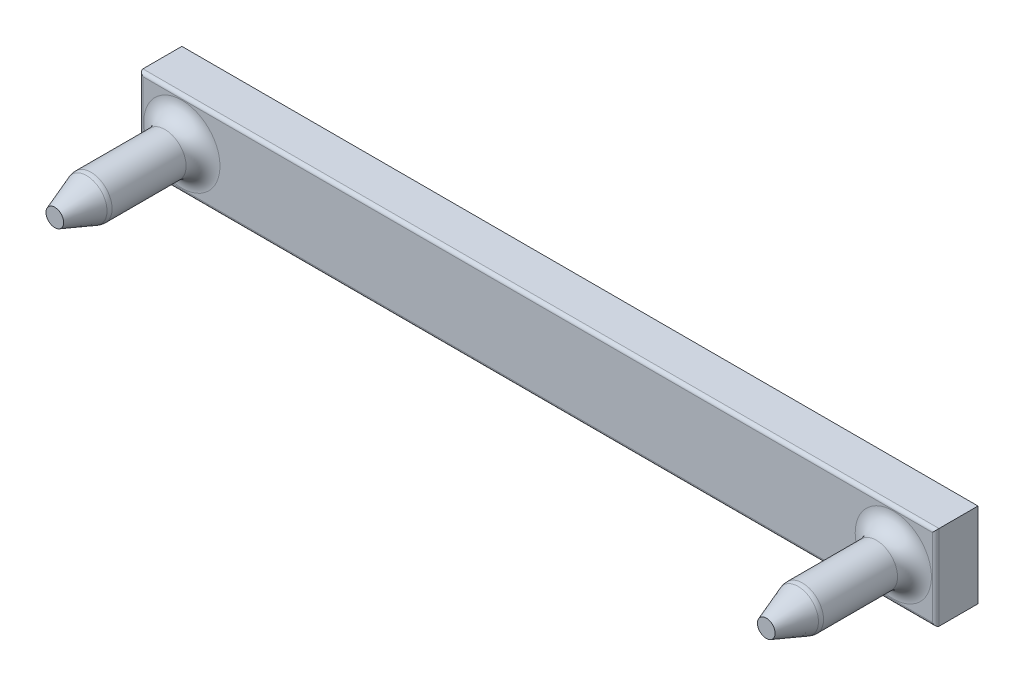
ISO-10303-21;
HEADER;
FILE_DESCRIPTION(('STEP AP214'),'2;1');
FILE_NAME('part.step','',(''),(''),'','','');
FILE_SCHEMA(('AUTOMOTIVE_DESIGN { 1 0 10303 214 1 1 1 1 }'));
ENDSEC;
DATA;
#1=APPLICATION_CONTEXT('core data for automotive mechanical design processes');
#2=APPLICATION_PROTOCOL_DEFINITION('international standard','automotive_design',2000,#1);
#3=PRODUCT_CONTEXT('',#1,'mechanical');
#4=PRODUCT('Part','Part','',(#3));
#5=PRODUCT_RELATED_PRODUCT_CATEGORY('part','',(#4));
#6=PRODUCT_DEFINITION_FORMATION('','',#4);
#7=PRODUCT_DEFINITION_CONTEXT('part definition',#1,'design');
#8=PRODUCT_DEFINITION('design','',#6,#7);
#9=PRODUCT_DEFINITION_SHAPE('','',#8);
#10=(LENGTH_UNIT() NAMED_UNIT(*) SI_UNIT(.MILLI.,.METRE.));
#11=(NAMED_UNIT(*) PLANE_ANGLE_UNIT() SI_UNIT($,.RADIAN.));
#12=(NAMED_UNIT(*) SI_UNIT($,.STERADIAN.) SOLID_ANGLE_UNIT());
#13=UNCERTAINTY_MEASURE_WITH_UNIT(LENGTH_MEASURE(1.E-05),#10,'distance_accuracy_value','');
#14=(GEOMETRIC_REPRESENTATION_CONTEXT(3) GLOBAL_UNCERTAINTY_ASSIGNED_CONTEXT((#13)) GLOBAL_UNIT_ASSIGNED_CONTEXT((#10,
#11,#12)) REPRESENTATION_CONTEXT('',''));
#15=CARTESIAN_POINT('',(0.,0.,0.));
#16=DIRECTION('',(0.,0.,1.));
#17=DIRECTION('',(1.,0.,0.));
#18=AXIS2_PLACEMENT_3D('',#15,#16,#17);
#19=CARTESIAN_POINT('',(-92.,8.,-15.));
#20=DIRECTION('',(0.,0.,1.));
#21=DIRECTION('',(1.,0.,0.));
#22=AXIS2_PLACEMENT_3D('',#19,#20,#21);
#23=CYLINDRICAL_SURFACE('',#22,2.5);
#24=CARTESIAN_POINT('',(-92.,8.,-4.26449047106265));
#25=DIRECTION('',(0.,0.,1.));
#26=DIRECTION('',(1.,0.,0.));
#27=AXIS2_PLACEMENT_3D('',#24,#25,#26);
#28=CIRCLE('',#27,2.5);
#29=CARTESIAN_POINT('',(-89.5,8.,-4.26449047106265));
#30=VERTEX_POINT('',#29);
#31=EDGE_CURVE('E51',#30,#30,#28,.F.);
#32=ORIENTED_EDGE('',*,*,#31,.T.);
#33=EDGE_LOOP('',(#32));
#34=FACE_BOUND('',#33,.T.);
#35=CARTESIAN_POINT('',(-92.,8.,-13.));
#36=DIRECTION('',(0.,0.,-1.));
#37=DIRECTION('',(-1.,0.,0.));
#38=AXIS2_PLACEMENT_3D('',#35,#36,#37);
#39=CIRCLE('',#38,2.5);
#40=CARTESIAN_POINT('',(-94.5,8.,-13.));
#41=VERTEX_POINT('',#40);
#42=EDGE_CURVE('E128',#41,#41,#39,.F.);
#43=ORIENTED_EDGE('',*,*,#42,.T.);
#44=EDGE_LOOP('',(#43));
#45=FACE_BOUND('',#44,.T.);
#46=ADVANCED_FACE('F43',(#34,#45),#23,.T.);
#47=CARTESIAN_POINT('',(-92.,8.,0.));
#48=DIRECTION('',(0.,0.,1.));
#49=DIRECTION('',(1.,0.,0.));
#50=AXIS2_PLACEMENT_3D('',#47,#48,#49);
#51=PLANE('',#50);
#52=CARTESIAN_POINT('',(-92.,8.,0.));
#53=DIRECTION('',(0.,0.,1.));
#54=DIRECTION('',(1.,0.,0.));
#55=AXIS2_PLACEMENT_3D('',#52,#53,#54);
#56=CIRCLE('',#55,1.04411906293521);
#57=CARTESIAN_POINT('',(-90.9558809370648,8.,0.));
#58=VERTEX_POINT('',#57);
#59=EDGE_CURVE('E159',#58,#58,#56,.T.);
#60=ORIENTED_EDGE('',*,*,#59,.T.);
#61=EDGE_LOOP('',(#60));
#62=FACE_BOUND('',#61,.T.);
#63=ADVANCED_FACE('F182',(#62),#51,.T.);
#64=CARTESIAN_POINT('',(-97.,3.,-20.));
#65=DIRECTION('',(0.,1.,0.));
#66=DIRECTION('',(-1.,0.,0.));
#67=AXIS2_PLACEMENT_3D('',#64,#65,#66);
#68=PLANE('',#67);
#69=DIRECTION('',(0.,0.,1.));
#70=VECTOR('',#69,1.);
#71=CARTESIAN_POINT('',(-3.,3.,-20.));
#72=LINE('',#71,#70);
#73=CARTESIAN_POINT('',(-3.,3.,-20.));
#74=VERTEX_POINT('',#73);
#75=CARTESIAN_POINT('',(-3.,3.,-15.4));
#76=VERTEX_POINT('',#75);
#77=EDGE_CURVE('E388',#74,#76,#72,.T.);
#78=ORIENTED_EDGE('',*,*,#77,.T.);
#79=DIRECTION('',(-1.,0.,0.));
#80=VECTOR('',#79,1.);
#81=CARTESIAN_POINT('',(-97.,3.,-15.4));
#82=LINE('',#81,#80);
#83=CARTESIAN_POINT('',(-97.,3.,-15.4));
#84=VERTEX_POINT('',#83);
#85=EDGE_CURVE('E58',#76,#84,#82,.T.);
#86=ORIENTED_EDGE('',*,*,#85,.T.);
#87=DIRECTION('',(0.,0.,1.));
#88=VECTOR('',#87,1.);
#89=CARTESIAN_POINT('',(-97.,3.,-20.));
#90=LINE('',#89,#88);
#91=CARTESIAN_POINT('',(-97.,3.,-20.));
#92=VERTEX_POINT('',#91);
#93=EDGE_CURVE('E99',#92,#84,#90,.T.);
#94=ORIENTED_EDGE('',*,*,#93,.F.);
#95=DIRECTION('',(-1.,0.,0.));
#96=VECTOR('',#95,1.);
#97=CARTESIAN_POINT('',(-97.,3.,-20.));
#98=LINE('',#97,#96);
#99=EDGE_CURVE('E104',#74,#92,#98,.T.);
#100=ORIENTED_EDGE('',*,*,#99,.F.);
#101=EDGE_LOOP('',(#78,#86,#94,#100));
#102=FACE_BOUND('',#101,.T.);
#103=ADVANCED_FACE('F113',(#102),#68,.F.);
#104=CARTESIAN_POINT('',(-97.,3.,-20.));
#105=DIRECTION('',(1.,0.,0.));
#106=DIRECTION('',(0.,0.,-1.));
#107=AXIS2_PLACEMENT_3D('',#104,#105,#106);
#108=PLANE('',#107);
#109=ORIENTED_EDGE('',*,*,#93,.T.);
#110=DIRECTION('',(0.,1.,0.));
#111=VECTOR('',#110,1.);
#112=CARTESIAN_POINT('',(-97.,3.,-15.4));
#113=LINE('',#112,#111);
#114=CARTESIAN_POINT('',(-97.,13.,-15.4));
#115=VERTEX_POINT('',#114);
#116=EDGE_CURVE('E65',#84,#115,#113,.T.);
#117=ORIENTED_EDGE('',*,*,#116,.T.);
#118=DIRECTION('',(0.,0.,1.));
#119=VECTOR('',#118,1.);
#120=CARTESIAN_POINT('',(-97.,13.,-20.));
#121=LINE('',#120,#119);
#122=CARTESIAN_POINT('',(-97.,13.,-20.));
#123=VERTEX_POINT('',#122);
#124=EDGE_CURVE('E100',#123,#115,#121,.T.);
#125=ORIENTED_EDGE('',*,*,#124,.F.);
#126=DIRECTION('',(0.,1.,0.));
#127=VECTOR('',#126,1.);
#128=CARTESIAN_POINT('',(-97.,3.,-20.));
#129=LINE('',#128,#127);
#130=EDGE_CURVE('E96',#92,#123,#129,.T.);
#131=ORIENTED_EDGE('',*,*,#130,.F.);
#132=EDGE_LOOP('',(#109,#117,#125,#131));
#133=FACE_BOUND('',#132,.T.);
#134=ADVANCED_FACE('F98',(#133),#108,.F.);
#135=CARTESIAN_POINT('',(-97.,13.,-20.));
#136=DIRECTION('',(0.,-1.,0.));
#137=DIRECTION('',(0.,0.,-1.));
#138=AXIS2_PLACEMENT_3D('',#135,#136,#137);
#139=PLANE('',#138);
#140=ORIENTED_EDGE('',*,*,#124,.T.);
#141=DIRECTION('',(1.,0.,0.));
#142=VECTOR('',#141,1.);
#143=CARTESIAN_POINT('',(-97.,13.,-15.4));
#144=LINE('',#143,#142);
#145=CARTESIAN_POINT('',(-3.,13.,-15.4));
#146=VERTEX_POINT('',#145);
#147=EDGE_CURVE('E143',#115,#146,#144,.T.);
#148=ORIENTED_EDGE('',*,*,#147,.T.);
#149=DIRECTION('',(0.,0.,1.));
#150=VECTOR('',#149,1.);
#151=CARTESIAN_POINT('',(-3.,13.,-20.));
#152=LINE('',#151,#150);
#153=CARTESIAN_POINT('',(-3.,13.,-20.));
#154=VERTEX_POINT('',#153);
#155=EDGE_CURVE('E119',#154,#146,#152,.T.);
#156=ORIENTED_EDGE('',*,*,#155,.F.);
#157=DIRECTION('',(1.,0.,0.));
#158=VECTOR('',#157,1.);
#159=CARTESIAN_POINT('',(-97.,13.,-20.));
#160=LINE('',#159,#158);
#161=EDGE_CURVE('E103',#123,#154,#160,.T.);
#162=ORIENTED_EDGE('',*,*,#161,.F.);
#163=EDGE_LOOP('',(#140,#148,#156,#162));
#164=FACE_BOUND('',#163,.T.);
#165=ADVANCED_FACE('F307',(#164),#139,.F.);
#166=CARTESIAN_POINT('',(-3.,13.,-20.));
#167=DIRECTION('',(-1.,0.,0.));
#168=DIRECTION('',(0.,0.,1.));
#169=AXIS2_PLACEMENT_3D('',#166,#167,#168);
#170=PLANE('',#169);
#171=ORIENTED_EDGE('',*,*,#155,.T.);
#172=DIRECTION('',(0.,-1.,0.));
#173=VECTOR('',#172,1.);
#174=CARTESIAN_POINT('',(-3.,13.,-15.4));
#175=LINE('',#174,#173);
#176=EDGE_CURVE('E131',#146,#76,#175,.T.);
#177=ORIENTED_EDGE('',*,*,#176,.T.);
#178=ORIENTED_EDGE('',*,*,#77,.F.);
#179=DIRECTION('',(0.,-1.,0.));
#180=VECTOR('',#179,1.);
#181=CARTESIAN_POINT('',(-3.,13.,-20.));
#182=LINE('',#181,#180);
#183=EDGE_CURVE('E109',#154,#74,#182,.T.);
#184=ORIENTED_EDGE('',*,*,#183,.F.);
#185=EDGE_LOOP('',(#171,#177,#178,#184));
#186=FACE_BOUND('',#185,.T.);
#187=ADVANCED_FACE('F299',(#186),#170,.F.);
#188=CARTESIAN_POINT('',(0.,0.,-20.));
#189=DIRECTION('',(0.,0.,-1.));
#190=DIRECTION('',(-1.,0.,0.));
#191=AXIS2_PLACEMENT_3D('',#188,#189,#190);
#192=PLANE('',#191);
#193=ORIENTED_EDGE('',*,*,#99,.T.);
#194=ORIENTED_EDGE('',*,*,#130,.T.);
#195=ORIENTED_EDGE('',*,*,#161,.T.);
#196=ORIENTED_EDGE('',*,*,#183,.T.);
#197=EDGE_LOOP('',(#193,#194,#195,#196));
#198=FACE_BOUND('',#197,.T.);
#199=ADVANCED_FACE('F107',(#198),#192,.T.);
#200=CARTESIAN_POINT('',(0.,0.,-15.));
#201=DIRECTION('',(0.,0.,-1.));
#202=DIRECTION('',(-1.,0.,0.));
#203=AXIS2_PLACEMENT_3D('',#200,#201,#202);
#204=PLANE('',#203);
#205=DIRECTION('',(-1.,0.,0.));
#206=VECTOR('',#205,1.);
#207=CARTESIAN_POINT('',(0.,3.4,-15.));
#208=LINE('',#207,#206);
#209=CARTESIAN_POINT('',(-96.6,3.4,-15.));
#210=VERTEX_POINT('',#209);
#211=CARTESIAN_POINT('',(-3.4,3.4,-15.));
#212=VERTEX_POINT('',#211);
#213=EDGE_CURVE('E134',#210,#212,#208,.F.);
#214=ORIENTED_EDGE('',*,*,#213,.T.);
#215=DIRECTION('',(0.,-1.,0.));
#216=VECTOR('',#215,1.);
#217=CARTESIAN_POINT('',(-3.4,0.,-15.));
#218=LINE('',#217,#216);
#219=CARTESIAN_POINT('',(-3.4,12.6,-15.));
#220=VERTEX_POINT('',#219);
#221=EDGE_CURVE('E140',#212,#220,#218,.F.);
#222=ORIENTED_EDGE('',*,*,#221,.T.);
#223=DIRECTION('',(1.,0.,0.));
#224=VECTOR('',#223,1.);
#225=CARTESIAN_POINT('',(0.,12.6,-15.));
#226=LINE('',#225,#224);
#227=CARTESIAN_POINT('',(-96.6,12.6,-15.));
#228=VERTEX_POINT('',#227);
#229=EDGE_CURVE('E138',#220,#228,#226,.F.);
#230=ORIENTED_EDGE('',*,*,#229,.T.);
#231=DIRECTION('',(0.,1.,0.));
#232=VECTOR('',#231,1.);
#233=CARTESIAN_POINT('',(-96.6,0.,-15.));
#234=LINE('',#233,#232);
#235=EDGE_CURVE('E136',#228,#210,#234,.F.);
#236=ORIENTED_EDGE('',*,*,#235,.T.);
#237=EDGE_LOOP('',(#214,#222,#230,#236));
#238=FACE_BOUND('',#237,.T.);
#239=CARTESIAN_POINT('',(-8.,8.,-15.));
#240=DIRECTION('',(0.,0.,-1.));
#241=DIRECTION('',(-1.,0.,0.));
#242=AXIS2_PLACEMENT_3D('',#239,#240,#241);
#243=CIRCLE('',#242,4.5);
#244=CARTESIAN_POINT('',(-12.5,8.,-15.));
#245=VERTEX_POINT('',#244);
#246=EDGE_CURVE('E125',#245,#245,#243,.T.);
#247=ORIENTED_EDGE('',*,*,#246,.T.);
#248=EDGE_LOOP('',(#247));
#249=FACE_BOUND('',#248,.T.);
#250=CARTESIAN_POINT('',(-92.,8.,-15.));
#251=DIRECTION('',(0.,0.,-1.));
#252=DIRECTION('',(-1.,0.,0.));
#253=AXIS2_PLACEMENT_3D('',#250,#251,#252);
#254=CIRCLE('',#253,4.5);
#255=CARTESIAN_POINT('',(-96.5,8.,-15.));
#256=VERTEX_POINT('',#255);
#257=EDGE_CURVE('E117',#256,#256,#254,.T.);
#258=ORIENTED_EDGE('',*,*,#257,.T.);
#259=EDGE_LOOP('',(#258));
#260=FACE_BOUND('',#259,.T.);
#261=ADVANCED_FACE('F286',(#238,#249,#260),#204,.F.);
#262=CARTESIAN_POINT('',(-8.,8.,-15.));
#263=DIRECTION('',(0.,0.,1.));
#264=DIRECTION('',(1.,0.,0.));
#265=AXIS2_PLACEMENT_3D('',#262,#263,#264);
#266=CYLINDRICAL_SURFACE('',#265,2.5);
#267=CARTESIAN_POINT('',(-8.,8.,-4.26449047106272));
#268=DIRECTION('',(0.,0.,1.));
#269=DIRECTION('',(1.,0.,0.));
#270=AXIS2_PLACEMENT_3D('',#267,#268,#269);
#271=CIRCLE('',#270,2.5);
#272=CARTESIAN_POINT('',(-5.5,8.,-4.26449047106272));
#273=VERTEX_POINT('',#272);
#274=EDGE_CURVE('E162',#273,#273,#271,.F.);
#275=ORIENTED_EDGE('',*,*,#274,.T.);
#276=EDGE_LOOP('',(#275));
#277=FACE_BOUND('',#276,.T.);
#278=CARTESIAN_POINT('',(-8.,8.,-13.));
#279=DIRECTION('',(0.,0.,-1.));
#280=DIRECTION('',(-1.,0.,0.));
#281=AXIS2_PLACEMENT_3D('',#278,#279,#280);
#282=CIRCLE('',#281,2.5);
#283=CARTESIAN_POINT('',(-10.5,8.,-13.));
#284=VERTEX_POINT('',#283);
#285=EDGE_CURVE('E114',#284,#284,#282,.F.);
#286=ORIENTED_EDGE('',*,*,#285,.T.);
#287=EDGE_LOOP('',(#286));
#288=FACE_BOUND('',#287,.T.);
#289=ADVANCED_FACE('F290',(#277,#288),#266,.T.);
#290=CARTESIAN_POINT('',(-8.,8.,0.));
#291=DIRECTION('',(0.,0.,1.));
#292=DIRECTION('',(1.,0.,0.));
#293=AXIS2_PLACEMENT_3D('',#290,#291,#292);
#294=PLANE('',#293);
#295=CARTESIAN_POINT('',(-8.,8.,0.));
#296=DIRECTION('',(0.,0.,1.));
#297=DIRECTION('',(1.,0.,0.));
#298=AXIS2_PLACEMENT_3D('',#295,#296,#297);
#299=CIRCLE('',#298,1.0441190629352);
#300=CARTESIAN_POINT('',(-6.9558809370648,8.,0.));
#301=VERTEX_POINT('',#300);
#302=EDGE_CURVE('E147',#301,#301,#299,.T.);
#303=ORIENTED_EDGE('',*,*,#302,.T.);
#304=EDGE_LOOP('',(#303));
#305=FACE_BOUND('',#304,.T.);
#306=ADVANCED_FACE('F197',(#305),#294,.T.);
#307=CARTESIAN_POINT('',(-8.,8.,-13.));
#308=DIRECTION('',(0.,0.,-1.));
#309=DIRECTION('',(-1.,0.,0.));
#310=AXIS2_PLACEMENT_3D('',#307,#308,#309);
#311=TOROIDAL_SURFACE('',#310,4.5,2.);
#312=ORIENTED_EDGE('',*,*,#246,.F.);
#313=EDGE_LOOP('',(#312));
#314=FACE_BOUND('',#313,.T.);
#315=ORIENTED_EDGE('',*,*,#285,.F.);
#316=EDGE_LOOP('',(#315));
#317=FACE_BOUND('',#316,.T.);
#318=ADVANCED_FACE('F193',(#314,#317),#311,.F.);
#319=CARTESIAN_POINT('',(-92.,8.,-13.));
#320=DIRECTION('',(0.,0.,-1.));
#321=DIRECTION('',(-1.,0.,0.));
#322=AXIS2_PLACEMENT_3D('',#319,#320,#321);
#323=TOROIDAL_SURFACE('',#322,4.5,2.);
#324=ORIENTED_EDGE('',*,*,#257,.F.);
#325=EDGE_LOOP('',(#324));
#326=FACE_BOUND('',#325,.T.);
#327=ORIENTED_EDGE('',*,*,#42,.F.);
#328=EDGE_LOOP('',(#327));
#329=FACE_BOUND('',#328,.T.);
#330=ADVANCED_FACE('F196',(#326,#329),#323,.F.);
#331=CARTESIAN_POINT('',(-96.6,3.,-15.4));
#332=DIRECTION('',(0.,1.,0.));
#333=DIRECTION('',(0.,0.,1.));
#334=AXIS2_PLACEMENT_3D('',#331,#332,#333);
#335=CYLINDRICAL_SURFACE('',#334,0.4);
#336=CARTESIAN_POINT('',(-96.6,3.4,-15.4));
#337=DIRECTION('',(-0.707106781186547,0.707106781186547,0.));
#338=DIRECTION('',(-0.707106781186547,-0.707106781186547,0.));
#339=AXIS2_PLACEMENT_3D('',#336,#337,#338);
#340=ELLIPSE('',#339,0.565685424949238,0.4);
#341=EDGE_CURVE('E152',#210,#84,#340,.F.);
#342=ORIENTED_EDGE('',*,*,#341,.F.);
#343=ORIENTED_EDGE('',*,*,#235,.F.);
#344=CARTESIAN_POINT('',(-96.6,12.6,-15.4));
#345=DIRECTION('',(0.707106781186547,0.707106781186547,0.));
#346=DIRECTION('',(-0.707106781186547,0.707106781186547,0.));
#347=AXIS2_PLACEMENT_3D('',#344,#345,#346);
#348=ELLIPSE('',#347,0.565685424949238,0.4);
#349=EDGE_CURVE('E111',#115,#228,#348,.T.);
#350=ORIENTED_EDGE('',*,*,#349,.F.);
#351=ORIENTED_EDGE('',*,*,#116,.F.);
#352=EDGE_LOOP('',(#342,#343,#350,#351));
#353=FACE_BOUND('',#352,.T.);
#354=ADVANCED_FACE('F201',(#353),#335,.T.);
#355=CARTESIAN_POINT('',(-97.,12.6,-15.4));
#356=DIRECTION('',(1.,0.,0.));
#357=DIRECTION('',(0.,0.,-1.));
#358=AXIS2_PLACEMENT_3D('',#355,#356,#357);
#359=CYLINDRICAL_SURFACE('',#358,0.4);
#360=ORIENTED_EDGE('',*,*,#349,.T.);
#361=ORIENTED_EDGE('',*,*,#229,.F.);
#362=CARTESIAN_POINT('',(-3.4,12.6,-15.4));
#363=DIRECTION('',(0.707106781186547,-0.707106781186547,0.));
#364=DIRECTION('',(0.707106781186547,0.707106781186547,0.));
#365=AXIS2_PLACEMENT_3D('',#362,#363,#364);
#366=ELLIPSE('',#365,0.565685424949238,0.4);
#367=EDGE_CURVE('E150',#146,#220,#366,.T.);
#368=ORIENTED_EDGE('',*,*,#367,.F.);
#369=ORIENTED_EDGE('',*,*,#147,.F.);
#370=EDGE_LOOP('',(#360,#361,#368,#369));
#371=FACE_BOUND('',#370,.T.);
#372=ADVANCED_FACE('F211',(#371),#359,.T.);
#373=CARTESIAN_POINT('',(-97.,3.4,-15.4));
#374=DIRECTION('',(-1.,0.,0.));
#375=DIRECTION('',(0.,-1.,0.));
#376=AXIS2_PLACEMENT_3D('',#373,#374,#375);
#377=CYLINDRICAL_SURFACE('',#376,0.4);
#378=ORIENTED_EDGE('',*,*,#341,.T.);
#379=ORIENTED_EDGE('',*,*,#85,.F.);
#380=CARTESIAN_POINT('',(-3.4,3.4,-15.4));
#381=DIRECTION('',(-0.707106781186547,-0.707106781186547,0.));
#382=DIRECTION('',(-0.707106781186547,0.707106781186547,0.));
#383=AXIS2_PLACEMENT_3D('',#380,#381,#382);
#384=ELLIPSE('',#383,0.565685424949238,0.4);
#385=EDGE_CURVE('E148',#212,#76,#384,.F.);
#386=ORIENTED_EDGE('',*,*,#385,.F.);
#387=ORIENTED_EDGE('',*,*,#213,.F.);
#388=EDGE_LOOP('',(#378,#379,#386,#387));
#389=FACE_BOUND('',#388,.T.);
#390=ADVANCED_FACE('F207',(#389),#377,.T.);
#391=CARTESIAN_POINT('',(-3.4,13.,-15.4));
#392=DIRECTION('',(0.,-1.,0.));
#393=DIRECTION('',(0.,0.,-1.));
#394=AXIS2_PLACEMENT_3D('',#391,#392,#393);
#395=CYLINDRICAL_SURFACE('',#394,0.4);
#396=ORIENTED_EDGE('',*,*,#367,.T.);
#397=ORIENTED_EDGE('',*,*,#221,.F.);
#398=ORIENTED_EDGE('',*,*,#385,.T.);
#399=ORIENTED_EDGE('',*,*,#176,.F.);
#400=EDGE_LOOP('',(#396,#397,#398,#399));
#401=FACE_BOUND('',#400,.T.);
#402=ADVANCED_FACE('F203',(#401),#395,.T.);
#403=CARTESIAN_POINT('',(-8.,8.,0.));
#404=DIRECTION('',(0.,0.,-1.));
#405=DIRECTION('',(-1.,0.,0.));
#406=AXIS2_PLACEMENT_3D('',#403,#404,#405);
#407=CONICAL_SURFACE('',#406,1.0441190629352,0.349065850398862);
#408=CARTESIAN_POINT('',(-8.,8.,-3.75146025607422));
#409=DIRECTION('',(0.,0.,1.));
#410=DIRECTION('',(1.,0.,0.));
#411=AXIS2_PLACEMENT_3D('',#408,#409,#410);
#412=CIRCLE('',#411,2.40953893117887);
#413=CARTESIAN_POINT('',(-5.59046106882113,8.,-3.75146025607422));
#414=VERTEX_POINT('',#413);
#415=EDGE_CURVE('E165',#414,#414,#412,.T.);
#416=ORIENTED_EDGE('',*,*,#415,.T.);
#417=EDGE_LOOP('',(#416));
#418=FACE_BOUND('',#417,.T.);
#419=ORIENTED_EDGE('',*,*,#302,.F.);
#420=EDGE_LOOP('',(#419));
#421=FACE_BOUND('',#420,.T.);
#422=ADVANCED_FACE('F206',(#418,#421),#407,.T.);
#423=CARTESIAN_POINT('',(-92.,8.,0.));
#424=DIRECTION('',(0.,0.,-1.));
#425=DIRECTION('',(-1.,0.,0.));
#426=AXIS2_PLACEMENT_3D('',#423,#424,#425);
#427=CONICAL_SURFACE('',#426,1.04411906293521,0.349065850398863);
#428=CARTESIAN_POINT('',(-92.,8.,-3.75146025607416));
#429=DIRECTION('',(0.,0.,1.));
#430=DIRECTION('',(1.,0.,0.));
#431=AXIS2_PLACEMENT_3D('',#428,#429,#430);
#432=CIRCLE('',#431,2.40953893117885);
#433=CARTESIAN_POINT('',(-89.5904610688211,8.,-3.75146025607416));
#434=VERTEX_POINT('',#433);
#435=EDGE_CURVE('E11',#434,#434,#432,.T.);
#436=ORIENTED_EDGE('',*,*,#435,.T.);
#437=EDGE_LOOP('',(#436));
#438=FACE_BOUND('',#437,.T.);
#439=ORIENTED_EDGE('',*,*,#59,.F.);
#440=EDGE_LOOP('',(#439));
#441=FACE_BOUND('',#440,.T.);
#442=ADVANCED_FACE('F178',(#438,#441),#427,.T.);
#443=CARTESIAN_POINT('',(-8.,8.,-4.26449047106272));
#444=DIRECTION('',(0.,0.,1.));
#445=DIRECTION('',(1.,0.,0.));
#446=AXIS2_PLACEMENT_3D('',#443,#444,#445);
#447=DEGENERATE_TOROIDAL_SURFACE('',#446,1.,1.5,.T.);
#448=ORIENTED_EDGE('',*,*,#415,.F.);
#449=EDGE_LOOP('',(#448));
#450=FACE_BOUND('',#449,.T.);
#451=ORIENTED_EDGE('',*,*,#274,.F.);
#452=EDGE_LOOP('',(#451));
#453=FACE_BOUND('',#452,.T.);
#454=ADVANCED_FACE('F173',(#450,#453),#447,.T.);
#455=CARTESIAN_POINT('',(-92.,8.,-4.26449047106265));
#456=DIRECTION('',(0.,0.,1.));
#457=DIRECTION('',(1.,0.,0.));
#458=AXIS2_PLACEMENT_3D('',#455,#456,#457);
#459=DEGENERATE_TOROIDAL_SURFACE('',#458,1.,1.5,.T.);
#460=ORIENTED_EDGE('',*,*,#435,.F.);
#461=EDGE_LOOP('',(#460));
#462=FACE_BOUND('',#461,.T.);
#463=ORIENTED_EDGE('',*,*,#31,.F.);
#464=EDGE_LOOP('',(#463));
#465=FACE_BOUND('',#464,.T.);
#466=ADVANCED_FACE('F45',(#462,#465),#459,.T.);
#467=CLOSED_SHELL('',(#46,#63,#103,#134,#165,#187,#199,#261,#289,#306,#318,#330,#354,#372,#390,
#402,#422,#442,#454,#466));
#468=MANIFOLD_SOLID_BREP('B2',#467);
#469=ADVANCED_BREP_SHAPE_REPRESENTATION('',(#18,#468),#14);
#470=SHAPE_DEFINITION_REPRESENTATION(#9,#469);
ENDSEC;
END-ISO-10303-21;
